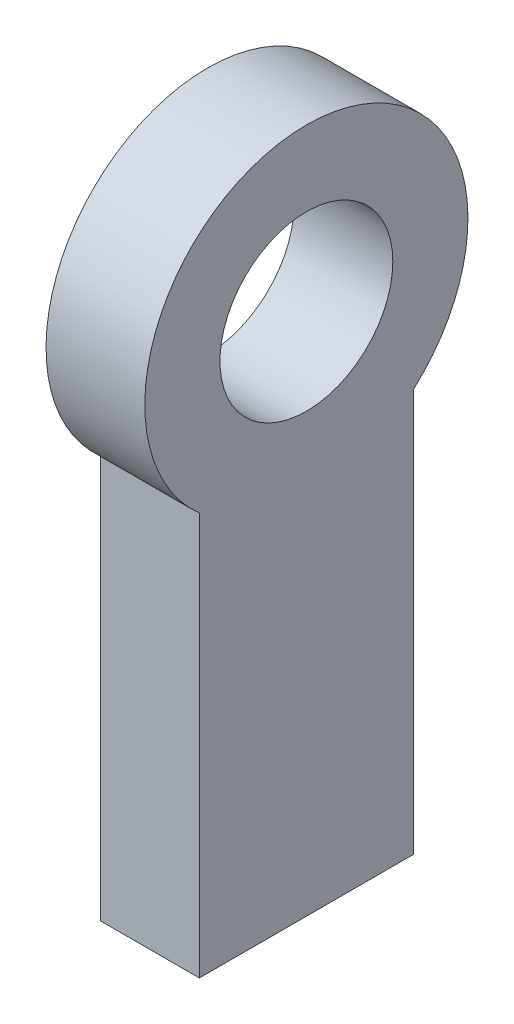
ISO-10303-21;
HEADER;
FILE_DESCRIPTION(('STEP AP214'),'2;1');
FILE_NAME('part.step','',(''),(''),'','','');
FILE_SCHEMA(('AUTOMOTIVE_DESIGN { 1 0 10303 214 1 1 1 1 }'));
ENDSEC;
DATA;
#1=APPLICATION_CONTEXT('core data for automotive mechanical design processes');
#2=APPLICATION_PROTOCOL_DEFINITION('international standard','automotive_design',2000,#1);
#3=PRODUCT_CONTEXT('',#1,'mechanical');
#4=PRODUCT('Part','Part','',(#3));
#5=PRODUCT_RELATED_PRODUCT_CATEGORY('part','',(#4));
#6=PRODUCT_DEFINITION_FORMATION('','',#4);
#7=PRODUCT_DEFINITION_CONTEXT('part definition',#1,'design');
#8=PRODUCT_DEFINITION('design','',#6,#7);
#9=PRODUCT_DEFINITION_SHAPE('','',#8);
#10=(LENGTH_UNIT() NAMED_UNIT(*) SI_UNIT(.MILLI.,.METRE.));
#11=(NAMED_UNIT(*) PLANE_ANGLE_UNIT() SI_UNIT($,.RADIAN.));
#12=(NAMED_UNIT(*) SI_UNIT($,.STERADIAN.) SOLID_ANGLE_UNIT());
#13=UNCERTAINTY_MEASURE_WITH_UNIT(LENGTH_MEASURE(1.E-05),#10,'distance_accuracy_value','');
#14=(GEOMETRIC_REPRESENTATION_CONTEXT(3) GLOBAL_UNCERTAINTY_ASSIGNED_CONTEXT((#13)) GLOBAL_UNIT_ASSIGNED_CONTEXT((#10,
#11,#12)) REPRESENTATION_CONTEXT('',''));
#15=CARTESIAN_POINT('',(0.,0.,0.));
#16=DIRECTION('',(0.,0.,1.));
#17=DIRECTION('',(1.,0.,0.));
#18=AXIS2_PLACEMENT_3D('',#15,#16,#17);
#19=CARTESIAN_POINT('',(6.00000000000023,1.66533453693773E-13,0.));
#20=DIRECTION('',(1.,0.,0.));
#21=DIRECTION('',(0.,0.,-1.));
#22=AXIS2_PLACEMENT_3D('',#19,#20,#21);
#23=PLANE('',#22);
#24=DIRECTION('',(0.,-1.,0.));
#25=VECTOR('',#24,1.);
#26=CARTESIAN_POINT('',(6.00000000000001,-31.8149545762236,6.50000000000001));
#27=LINE('',#26,#25);
#28=CARTESIAN_POINT('',(6.00000000000001,-7.35413715763668,6.50000000000001));
#29=VERTEX_POINT('',#28);
#30=CARTESIAN_POINT('',(6.00000000000001,-31.8149545762236,6.50000000000001));
#31=VERTEX_POINT('',#30);
#32=EDGE_CURVE('E86',#29,#31,#27,.T.);
#33=ORIENTED_EDGE('',*,*,#32,.T.);
#34=DIRECTION('',(0.,0.,-1.));
#35=VECTOR('',#34,1.);
#36=CARTESIAN_POINT('',(6.00000000000001,-31.8149545762236,6.50000000000001));
#37=LINE('',#36,#35);
#38=CARTESIAN_POINT('',(6.00000000000001,-31.8149545762236,-6.50000000000001));
#39=VERTEX_POINT('',#38);
#40=EDGE_CURVE('E81',#31,#39,#37,.T.);
#41=ORIENTED_EDGE('',*,*,#40,.T.);
#42=DIRECTION('',(0.,1.,0.));
#43=VECTOR('',#42,1.);
#44=CARTESIAN_POINT('',(6.00000000000001,-31.8149545762236,-6.50000000000001));
#45=LINE('',#44,#43);
#46=CARTESIAN_POINT('',(6.00000000000001,-7.35413715763666,-6.50000000000001));
#47=VERTEX_POINT('',#46);
#48=EDGE_CURVE('E84',#39,#47,#45,.T.);
#49=ORIENTED_EDGE('',*,*,#48,.T.);
#50=CARTESIAN_POINT('',(6.00000000000023,1.66533453693773E-13,0.));
#51=DIRECTION('',(1.,0.,0.));
#52=DIRECTION('',(0.,0.,-1.));
#53=AXIS2_PLACEMENT_3D('',#50,#51,#52);
#54=CIRCLE('',#53,9.81495457622364);
#55=EDGE_CURVE('E51',#47,#29,#54,.T.);
#56=ORIENTED_EDGE('',*,*,#55,.T.);
#57=EDGE_LOOP('',(#33,#41,#49,#56));
#58=FACE_BOUND('',#57,.T.);
#59=CARTESIAN_POINT('',(6.00000000000023,1.66533453693773E-13,0.));
#60=DIRECTION('',(1.,0.,0.));
#61=DIRECTION('',(0.,0.,-1.));
#62=AXIS2_PLACEMENT_3D('',#59,#60,#61);
#63=CIRCLE('',#62,5.25);
#64=CARTESIAN_POINT('',(6.00000000000023,1.66533453693774E-13,-5.25));
#65=VERTEX_POINT('',#64);
#66=EDGE_CURVE('E101',#65,#65,#63,.T.);
#67=ORIENTED_EDGE('',*,*,#66,.F.);
#68=EDGE_LOOP('',(#67));
#69=FACE_BOUND('',#68,.T.);
#70=ADVANCED_FACE('F34',(#58,#69),#23,.T.);
#71=CARTESIAN_POINT('',(0.,0.,0.));
#72=DIRECTION('',(1.,0.,0.));
#73=DIRECTION('',(0.,0.,-1.));
#74=AXIS2_PLACEMENT_3D('',#71,#72,#73);
#75=PLANE('',#74);
#76=DIRECTION('',(0.,-1.,0.));
#77=VECTOR('',#76,1.);
#78=CARTESIAN_POINT('',(0.,-31.8149545762235,6.50000000000001));
#79=LINE('',#78,#77);
#80=CARTESIAN_POINT('',(0.,-7.35413715763657,6.50000000000001));
#81=VERTEX_POINT('',#80);
#82=CARTESIAN_POINT('',(0.,-31.8149545762235,6.50000000000001));
#83=VERTEX_POINT('',#82);
#84=EDGE_CURVE('E98',#81,#83,#79,.T.);
#85=ORIENTED_EDGE('',*,*,#84,.F.);
#86=CARTESIAN_POINT('',(0.,0.,0.));
#87=DIRECTION('',(1.,0.,0.));
#88=DIRECTION('',(0.,0.,-1.));
#89=AXIS2_PLACEMENT_3D('',#86,#87,#88);
#90=CIRCLE('',#89,9.81495457622364);
#91=CARTESIAN_POINT('',(0.,-7.35413715763655,-6.50000000000001));
#92=VERTEX_POINT('',#91);
#93=EDGE_CURVE('E74',#92,#81,#90,.T.);
#94=ORIENTED_EDGE('',*,*,#93,.F.);
#95=DIRECTION('',(0.,1.,0.));
#96=VECTOR('',#95,1.);
#97=CARTESIAN_POINT('',(0.,-31.8149545762235,-6.50000000000001));
#98=LINE('',#97,#96);
#99=CARTESIAN_POINT('',(0.,-31.8149545762235,-6.50000000000001));
#100=VERTEX_POINT('',#99);
#101=EDGE_CURVE('E68',#100,#92,#98,.T.);
#102=ORIENTED_EDGE('',*,*,#101,.F.);
#103=DIRECTION('',(0.,0.,-1.));
#104=VECTOR('',#103,1.);
#105=CARTESIAN_POINT('',(0.,-31.8149545762235,6.50000000000001));
#106=LINE('',#105,#104);
#107=EDGE_CURVE('E90',#83,#100,#106,.T.);
#108=ORIENTED_EDGE('',*,*,#107,.F.);
#109=EDGE_LOOP('',(#85,#94,#102,#108));
#110=FACE_BOUND('',#109,.T.);
#111=CARTESIAN_POINT('',(0.,0.,0.));
#112=DIRECTION('',(1.,0.,0.));
#113=DIRECTION('',(0.,0.,-1.));
#114=AXIS2_PLACEMENT_3D('',#111,#112,#113);
#115=CIRCLE('',#114,5.25);
#116=CARTESIAN_POINT('',(0.,0.,-5.25));
#117=VERTEX_POINT('',#116);
#118=EDGE_CURVE('E113',#117,#117,#115,.T.);
#119=ORIENTED_EDGE('',*,*,#118,.T.);
#120=EDGE_LOOP('',(#119));
#121=FACE_BOUND('',#120,.T.);
#122=ADVANCED_FACE('F109',(#110,#121),#75,.F.);
#123=CARTESIAN_POINT('',(6.00000000000001,-31.8149545762236,6.50000000000001));
#124=DIRECTION('',(0.,0.,-1.));
#125=DIRECTION('',(-1.,0.,0.));
#126=AXIS2_PLACEMENT_3D('',#123,#124,#125);
#127=PLANE('',#126);
#128=ORIENTED_EDGE('',*,*,#84,.T.);
#129=DIRECTION('',(-1.,0.,0.));
#130=VECTOR('',#129,1.);
#131=CARTESIAN_POINT('',(6.00000000000001,-31.8149545762236,6.50000000000001));
#132=LINE('',#131,#130);
#133=EDGE_CURVE('E11',#31,#83,#132,.T.);
#134=ORIENTED_EDGE('',*,*,#133,.F.);
#135=ORIENTED_EDGE('',*,*,#32,.F.);
#136=DIRECTION('',(-1.,0.,0.));
#137=VECTOR('',#136,1.);
#138=CARTESIAN_POINT('',(6.00000000000001,-7.35413715763668,6.50000000000001));
#139=LINE('',#138,#137);
#140=EDGE_CURVE('E94',#29,#81,#139,.T.);
#141=ORIENTED_EDGE('',*,*,#140,.T.);
#142=EDGE_LOOP('',(#128,#134,#135,#141));
#143=FACE_BOUND('',#142,.T.);
#144=ADVANCED_FACE('F36',(#143),#127,.F.);
#145=CARTESIAN_POINT('',(6.00000000000001,-31.8149545762236,6.50000000000001));
#146=DIRECTION('',(0.,1.,0.));
#147=DIRECTION('',(0.,0.,1.));
#148=AXIS2_PLACEMENT_3D('',#145,#146,#147);
#149=PLANE('',#148);
#150=ORIENTED_EDGE('',*,*,#107,.T.);
#151=DIRECTION('',(-1.,0.,0.));
#152=VECTOR('',#151,1.);
#153=CARTESIAN_POINT('',(6.00000000000001,-31.8149545762236,-6.50000000000001));
#154=LINE('',#153,#152);
#155=EDGE_CURVE('E43',#39,#100,#154,.T.);
#156=ORIENTED_EDGE('',*,*,#155,.F.);
#157=ORIENTED_EDGE('',*,*,#40,.F.);
#158=ORIENTED_EDGE('',*,*,#133,.T.);
#159=EDGE_LOOP('',(#150,#156,#157,#158));
#160=FACE_BOUND('',#159,.T.);
#161=ADVANCED_FACE('F89',(#160),#149,.F.);
#162=CARTESIAN_POINT('',(6.00000000000001,-31.8149545762236,-6.50000000000001));
#163=DIRECTION('',(0.,0.,1.));
#164=DIRECTION('',(1.,0.,0.));
#165=AXIS2_PLACEMENT_3D('',#162,#163,#164);
#166=PLANE('',#165);
#167=ORIENTED_EDGE('',*,*,#101,.T.);
#168=DIRECTION('',(-1.,0.,0.));
#169=VECTOR('',#168,1.);
#170=CARTESIAN_POINT('',(6.00000000000001,-7.35413715763666,-6.50000000000001));
#171=LINE('',#170,#169);
#172=EDGE_CURVE('E91',#47,#92,#171,.T.);
#173=ORIENTED_EDGE('',*,*,#172,.F.);
#174=ORIENTED_EDGE('',*,*,#48,.F.);
#175=ORIENTED_EDGE('',*,*,#155,.T.);
#176=EDGE_LOOP('',(#167,#173,#174,#175));
#177=FACE_BOUND('',#176,.T.);
#178=ADVANCED_FACE('F92',(#177),#166,.F.);
#179=CARTESIAN_POINT('',(6.00000000000023,1.66533453693773E-13,0.));
#180=DIRECTION('',(-1.,0.,0.));
#181=DIRECTION('',(0.,0.,1.));
#182=AXIS2_PLACEMENT_3D('',#179,#180,#181);
#183=CYLINDRICAL_SURFACE('',#182,9.81495457622364);
#184=ORIENTED_EDGE('',*,*,#93,.T.);
#185=ORIENTED_EDGE('',*,*,#140,.F.);
#186=ORIENTED_EDGE('',*,*,#55,.F.);
#187=ORIENTED_EDGE('',*,*,#172,.T.);
#188=EDGE_LOOP('',(#184,#185,#186,#187));
#189=FACE_BOUND('',#188,.T.);
#190=ADVANCED_FACE('F106',(#189),#183,.T.);
#191=CARTESIAN_POINT('',(6.00000000000023,1.66533453693773E-13,0.));
#192=DIRECTION('',(-1.,0.,0.));
#193=DIRECTION('',(0.,0.,1.));
#194=AXIS2_PLACEMENT_3D('',#191,#192,#193);
#195=CYLINDRICAL_SURFACE('',#194,5.25);
#196=ORIENTED_EDGE('',*,*,#66,.T.);
#197=EDGE_LOOP('',(#196));
#198=FACE_BOUND('',#197,.T.);
#199=ORIENTED_EDGE('',*,*,#118,.F.);
#200=EDGE_LOOP('',(#199));
#201=FACE_BOUND('',#200,.T.);
#202=ADVANCED_FACE('F119',(#198,#201),#195,.F.);
#203=CLOSED_SHELL('',(#70,#122,#144,#161,#178,#190,#202));
#204=MANIFOLD_SOLID_BREP('B2',#203);
#205=ADVANCED_BREP_SHAPE_REPRESENTATION('',(#18,#204),#14);
#206=SHAPE_DEFINITION_REPRESENTATION(#9,#205);
ENDSEC;
END-ISO-10303-21;
